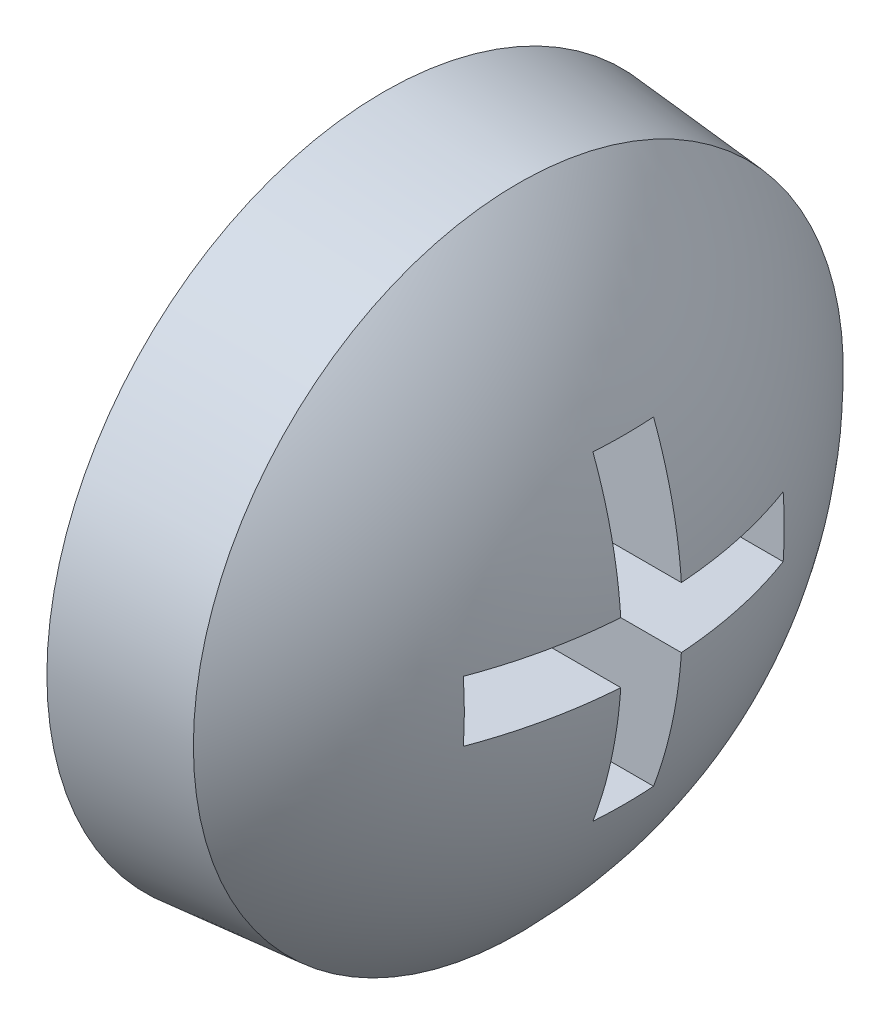
ISO-10303-21;
HEADER;
FILE_DESCRIPTION(('STEP AP214'),'2;1');
FILE_NAME('part.step','',(''),(''),'','','');
FILE_SCHEMA(('AUTOMOTIVE_DESIGN { 1 0 10303 214 1 1 1 1 }'));
ENDSEC;
DATA;
#1=APPLICATION_CONTEXT('core data for automotive mechanical design processes');
#2=APPLICATION_PROTOCOL_DEFINITION('international standard','automotive_design',2000,#1);
#3=PRODUCT_CONTEXT('',#1,'mechanical');
#4=PRODUCT('Part','Part','',(#3));
#5=PRODUCT_RELATED_PRODUCT_CATEGORY('part','',(#4));
#6=PRODUCT_DEFINITION_FORMATION('','',#4);
#7=PRODUCT_DEFINITION_CONTEXT('part definition',#1,'design');
#8=PRODUCT_DEFINITION('design','',#6,#7);
#9=PRODUCT_DEFINITION_SHAPE('','',#8);
#10=(LENGTH_UNIT() NAMED_UNIT(*) SI_UNIT(.MILLI.,.METRE.));
#11=(NAMED_UNIT(*) PLANE_ANGLE_UNIT() SI_UNIT($,.RADIAN.));
#12=(NAMED_UNIT(*) SI_UNIT($,.STERADIAN.) SOLID_ANGLE_UNIT());
#13=UNCERTAINTY_MEASURE_WITH_UNIT(LENGTH_MEASURE(1.E-05),#10,'distance_accuracy_value','');
#14=(GEOMETRIC_REPRESENTATION_CONTEXT(3) GLOBAL_UNCERTAINTY_ASSIGNED_CONTEXT((#13)) GLOBAL_UNIT_ASSIGNED_CONTEXT((#10,
#11,#12)) REPRESENTATION_CONTEXT('',''));
#15=CARTESIAN_POINT('',(0.,0.,0.));
#16=DIRECTION('',(0.,0.,1.));
#17=DIRECTION('',(1.,0.,0.));
#18=AXIS2_PLACEMENT_3D('',#15,#16,#17);
#19=CARTESIAN_POINT('',(215.733333333333,6.9,10.));
#20=DIRECTION('',(1.,0.,0.));
#21=DIRECTION('',(0.,0.,-1.));
#22=AXIS2_PLACEMENT_3D('',#19,#20,#21);
#23=PLANE('',#22);
#24=DIRECTION('',(0.,0.,1.));
#25=VECTOR('',#24,1.);
#26=CARTESIAN_POINT('',(215.733333333333,5.95,10.));
#27=LINE('',#26,#25);
#28=CARTESIAN_POINT('',(215.733333333333,5.95,9.82));
#29=VERTEX_POINT('',#28);
#30=CARTESIAN_POINT('',(215.733333333333,5.95,10.18));
#31=VERTEX_POINT('',#30);
#32=EDGE_CURVE('E293',#29,#31,#27,.T.);
#33=ORIENTED_EDGE('',*,*,#32,.F.);
#34=DIRECTION('',(0.,1.,0.));
#35=VECTOR('',#34,1.);
#36=CARTESIAN_POINT('',(215.733333333333,6.9,9.82));
#37=LINE('',#36,#35);
#38=CARTESIAN_POINT('',(215.733333333333,6.72,9.82));
#39=VERTEX_POINT('',#38);
#40=EDGE_CURVE('E298',#39,#29,#37,.F.);
#41=ORIENTED_EDGE('',*,*,#40,.F.);
#42=DIRECTION('',(0.,0.,1.));
#43=VECTOR('',#42,1.);
#44=CARTESIAN_POINT('',(215.733333333333,6.72,10.));
#45=LINE('',#44,#43);
#46=CARTESIAN_POINT('',(215.733333333333,6.72,9.05));
#47=VERTEX_POINT('',#46);
#48=EDGE_CURVE('E303',#47,#39,#45,.T.);
#49=ORIENTED_EDGE('',*,*,#48,.F.);
#50=DIRECTION('',(0.,1.,0.));
#51=VECTOR('',#50,1.);
#52=CARTESIAN_POINT('',(215.733333333333,6.9,9.05));
#53=LINE('',#52,#51);
#54=CARTESIAN_POINT('',(215.733333333333,7.08,9.05));
#55=VERTEX_POINT('',#54);
#56=EDGE_CURVE('E308',#55,#47,#53,.F.);
#57=ORIENTED_EDGE('',*,*,#56,.F.);
#58=DIRECTION('',(0.,0.,-1.));
#59=VECTOR('',#58,1.);
#60=CARTESIAN_POINT('',(215.733333333333,7.08,10.));
#61=LINE('',#60,#59);
#62=CARTESIAN_POINT('',(215.733333333333,7.08,9.82));
#63=VERTEX_POINT('',#62);
#64=EDGE_CURVE('E313',#63,#55,#61,.T.);
#65=ORIENTED_EDGE('',*,*,#64,.F.);
#66=DIRECTION('',(0.,1.,0.));
#67=VECTOR('',#66,1.);
#68=CARTESIAN_POINT('',(215.733333333333,6.9,9.82));
#69=LINE('',#68,#67);
#70=CARTESIAN_POINT('',(215.733333333333,7.85,9.82));
#71=VERTEX_POINT('',#70);
#72=EDGE_CURVE('E318',#71,#63,#69,.F.);
#73=ORIENTED_EDGE('',*,*,#72,.F.);
#74=DIRECTION('',(0.,0.,1.));
#75=VECTOR('',#74,1.);
#76=CARTESIAN_POINT('',(215.733333333333,7.85,10.));
#77=LINE('',#76,#75);
#78=CARTESIAN_POINT('',(215.733333333333,7.85,10.18));
#79=VERTEX_POINT('',#78);
#80=EDGE_CURVE('E267',#71,#79,#77,.T.);
#81=ORIENTED_EDGE('',*,*,#80,.T.);
#82=DIRECTION('',(0.,1.,0.));
#83=VECTOR('',#82,1.);
#84=CARTESIAN_POINT('',(215.733333333333,6.9,10.18));
#85=LINE('',#84,#83);
#86=CARTESIAN_POINT('',(215.733333333333,7.08,10.18));
#87=VERTEX_POINT('',#86);
#88=EDGE_CURVE('E264',#87,#79,#85,.T.);
#89=ORIENTED_EDGE('',*,*,#88,.F.);
#90=DIRECTION('',(0.,0.,-1.));
#91=VECTOR('',#90,1.);
#92=CARTESIAN_POINT('',(215.733333333333,7.08,10.));
#93=LINE('',#92,#91);
#94=CARTESIAN_POINT('',(215.733333333333,7.08,10.95));
#95=VERTEX_POINT('',#94);
#96=EDGE_CURVE('E260',#95,#87,#93,.T.);
#97=ORIENTED_EDGE('',*,*,#96,.F.);
#98=DIRECTION('',(0.,1.,0.));
#99=VECTOR('',#98,1.);
#100=CARTESIAN_POINT('',(215.733333333333,6.9,10.95));
#101=LINE('',#100,#99);
#102=CARTESIAN_POINT('',(215.733333333333,6.72,10.95));
#103=VERTEX_POINT('',#102);
#104=EDGE_CURVE('E231',#95,#103,#101,.F.);
#105=ORIENTED_EDGE('',*,*,#104,.T.);
#106=DIRECTION('',(0.,0.,1.));
#107=VECTOR('',#106,1.);
#108=CARTESIAN_POINT('',(215.733333333333,6.72,10.));
#109=LINE('',#108,#107);
#110=CARTESIAN_POINT('',(215.733333333333,6.72,10.18));
#111=VERTEX_POINT('',#110);
#112=EDGE_CURVE('E278',#111,#103,#109,.T.);
#113=ORIENTED_EDGE('',*,*,#112,.F.);
#114=DIRECTION('',(0.,1.,0.));
#115=VECTOR('',#114,1.);
#116=CARTESIAN_POINT('',(215.733333333333,6.9,10.18));
#117=LINE('',#116,#115);
#118=EDGE_CURVE('E288',#31,#111,#117,.T.);
#119=ORIENTED_EDGE('',*,*,#118,.F.);
#120=EDGE_LOOP('',(#33,#41,#49,#57,#65,#73,#81,#89,#97,#105,#113,#119));
#121=FACE_BOUND('',#120,.T.);
#122=ADVANCED_FACE('F17',(#121),#23,.T.);
#123=CARTESIAN_POINT('',(216.333333333333,7.08,10.));
#124=DIRECTION('',(0.,-1.,0.));
#125=DIRECTION('',(0.,0.,-1.));
#126=AXIS2_PLACEMENT_3D('',#123,#124,#125);
#127=PLANE('',#126);
#128=DIRECTION('',(1.,0.,0.));
#129=VECTOR('',#128,1.);
#130=CARTESIAN_POINT('',(216.333333333333,7.08,10.95));
#131=LINE('',#130,#129);
#132=CARTESIAN_POINT('',(216.756237856524,7.08,10.9500000000001));
#133=VERTEX_POINT('',#132);
#134=EDGE_CURVE('E89',#133,#95,#131,.F.);
#135=ORIENTED_EDGE('',*,*,#134,.T.);
#136=ORIENTED_EDGE('',*,*,#96,.T.);
#137=DIRECTION('',(-1.,0.,0.));
#138=VECTOR('',#137,1.);
#139=CARTESIAN_POINT('',(216.333333333333,7.08,10.18));
#140=LINE('',#139,#138);
#141=CARTESIAN_POINT('',(216.921430903127,7.08000000000001,10.18));
#142=VERTEX_POINT('',#141);
#143=EDGE_CURVE('E224',#142,#87,#140,.T.);
#144=ORIENTED_EDGE('',*,*,#143,.F.);
#145=CARTESIAN_POINT('',(216.756237856524,7.08,10.9500000000001));
#146=CARTESIAN_POINT('',(216.767782870718,7.08,10.9189995540507));
#147=CARTESIAN_POINT('',(216.778762253102,7.08,10.8877884938069));
#148=CARTESIAN_POINT('',(216.79953545164,7.08,10.825110453647));
#149=CARTESIAN_POINT('',(216.809333758651,7.08,10.7936449620742));
#150=CARTESIAN_POINT('',(216.827757299291,7.08,10.7304618501357));
#151=CARTESIAN_POINT('',(216.83638553892,7.08,10.6987451062673));
#152=CARTESIAN_POINT('',(216.852477288087,7.08,10.6350619663156));
#153=CARTESIAN_POINT('',(216.859942316909,7.08,10.6030959541243));
#154=CARTESIAN_POINT('',(216.873711495295,7.08,10.5389148788569));
#155=CARTESIAN_POINT('',(216.88001564486,7.08,10.5066998157809));
#156=CARTESIAN_POINT('',(216.891462392226,7.08,10.4420201537525));
#157=CARTESIAN_POINT('',(216.896603446971,7.08,10.4095552817086));
#158=CARTESIAN_POINT('',(216.905718495644,7.08,10.3443751591894));
#159=CARTESIAN_POINT('',(216.909689388573,7.08,10.3116594750373));
#160=CARTESIAN_POINT('',(216.916454375482,7.08,10.2459761632456));
#161=CARTESIAN_POINT('',(216.919243763301,7.08,10.2130080508538));
#162=CARTESIAN_POINT('',(216.921430903127,7.08,10.18));
#163=B_SPLINE_CURVE_WITH_KNOTS('',3,(#145,#146,#147,#148,#149,#150,#151,#152,#153,#154,#155,
#156,#157,#158,#159,#160,#161,#162),.UNSPECIFIED.,.F.,.F.,(4,2,2,2,2,2,2,2,4),(0.,
0.0992357442434492,0.198081387639303,0.296668072480549,0.395124892694158,0.49358171290778,
0.592168397749024,0.691014041144897,0.790249785388334),.UNSPECIFIED.);
#164=EDGE_CURVE('E20',#133,#142,#163,.T.);
#165=ORIENTED_EDGE('',*,*,#164,.F.);
#166=EDGE_LOOP('',(#135,#136,#144,#165));
#167=FACE_BOUND('',#166,.T.);
#168=ADVANCED_FACE('F221',(#167),#127,.T.);
#169=CARTESIAN_POINT('',(216.333333333333,6.9,10.18));
#170=DIRECTION('',(0.,0.,-1.));
#171=DIRECTION('',(-1.,0.,0.));
#172=AXIS2_PLACEMENT_3D('',#169,#170,#171);
#173=PLANE('',#172);
#174=ORIENTED_EDGE('',*,*,#88,.T.);
#175=DIRECTION('',(1.,0.,0.));
#176=VECTOR('',#175,1.);
#177=CARTESIAN_POINT('',(216.333333333333,7.85,10.18));
#178=LINE('',#177,#176);
#179=CARTESIAN_POINT('',(216.756237856524,7.85,10.18));
#180=VERTEX_POINT('',#179);
#181=EDGE_CURVE('E324',#79,#180,#178,.T.);
#182=ORIENTED_EDGE('',*,*,#181,.T.);
#183=CARTESIAN_POINT('',(216.921430903127,7.08000000000002,10.18));
#184=CARTESIAN_POINT('',(216.915776724439,7.16559008255584,10.18));
#185=CARTESIAN_POINT('',(216.906045237038,7.25090347737772,10.18));
#186=CARTESIAN_POINT('',(216.878678119522,7.41965906159773,10.18));
#187=CARTESIAN_POINT('',(216.861096565483,7.503110019482,10.18));
#188=CARTESIAN_POINT('',(216.816367435921,7.67504249159054,10.18));
#189=CARTESIAN_POINT('',(216.788531372825,7.76334531100357,10.18));
#190=CARTESIAN_POINT('',(216.756237856524,7.85000000000014,10.18));
#191=B_SPLINE_CURVE_WITH_KNOTS('',3,(#183,#184,#185,#186,#187,#188,#189,#190),.UNSPECIFIED.,.F.,
.F.,(4,2,2,4),(0.,0.257221658829358,0.512698117737381,0.789983486231736),.UNSPECIFIED.);
#192=EDGE_CURVE('E213',#142,#180,#191,.T.);
#193=ORIENTED_EDGE('',*,*,#192,.F.);
#194=ORIENTED_EDGE('',*,*,#143,.T.);
#195=EDGE_LOOP('',(#174,#182,#193,#194));
#196=FACE_BOUND('',#195,.T.);
#197=ADVANCED_FACE('F204',(#196),#173,.T.);
#198=CARTESIAN_POINT('',(216.333333333333,7.85,10.));
#199=DIRECTION('',(0.,1.,0.));
#200=DIRECTION('',(0.,0.,1.));
#201=AXIS2_PLACEMENT_3D('',#198,#199,#200);
#202=PLANE('',#201);
#203=ORIENTED_EDGE('',*,*,#181,.F.);
#204=ORIENTED_EDGE('',*,*,#80,.F.);
#205=DIRECTION('',(1.,0.,0.));
#206=VECTOR('',#205,1.);
#207=CARTESIAN_POINT('',(216.333333333333,7.85,9.82));
#208=LINE('',#207,#206);
#209=CARTESIAN_POINT('',(216.756237856524,7.85000000000008,9.82));
#210=VERTEX_POINT('',#209);
#211=EDGE_CURVE('E320',#210,#71,#208,.F.);
#212=ORIENTED_EDGE('',*,*,#211,.F.);
#213=CARTESIAN_POINT('',(216.756237856524,7.85,10.18));
#214=CARTESIAN_POINT('',(216.760466252223,7.85000000000002,10.12));
#215=CARTESIAN_POINT('',(216.762580450072,7.85000000000002,10.06));
#216=CARTESIAN_POINT('',(216.762580450072,7.84999999999998,9.93999999999995));
#217=CARTESIAN_POINT('',(216.760466252223,7.84999999999994,9.87999999999993));
#218=CARTESIAN_POINT('',(216.756237856524,7.84999999999989,9.81999999999991));
#219=B_SPLINE_CURVE_WITH_KNOTS('',3,(#213,#214,#215,#216,#217,#218),.UNSPECIFIED.,.F.,.F.,(4,2,
4),(0.,0.180111711148749,0.360223422297499),.UNSPECIFIED.);
#220=EDGE_CURVE('E207',#180,#210,#219,.T.);
#221=ORIENTED_EDGE('',*,*,#220,.F.);
#222=EDGE_LOOP('',(#203,#204,#212,#221));
#223=FACE_BOUND('',#222,.T.);
#224=ADVANCED_FACE('F199',(#223),#202,.F.);
#225=CARTESIAN_POINT('',(216.333333333333,6.9,9.82));
#226=DIRECTION('',(0.,0.,1.));
#227=DIRECTION('',(1.,0.,0.));
#228=AXIS2_PLACEMENT_3D('',#225,#226,#227);
#229=PLANE('',#228);
#230=ORIENTED_EDGE('',*,*,#72,.T.);
#231=DIRECTION('',(1.,0.,0.));
#232=VECTOR('',#231,1.);
#233=CARTESIAN_POINT('',(216.333333333333,7.08,9.82));
#234=LINE('',#233,#232);
#235=CARTESIAN_POINT('',(216.921430903127,7.08,9.81999999999999));
#236=VERTEX_POINT('',#235);
#237=EDGE_CURVE('E315',#236,#63,#234,.F.);
#238=ORIENTED_EDGE('',*,*,#237,.F.);
#239=CARTESIAN_POINT('',(216.756237856524,7.85000000000015,9.82));
#240=CARTESIAN_POINT('',(216.767782870718,7.81899955405073,9.82));
#241=CARTESIAN_POINT('',(216.778762253102,7.78778849380686,9.82));
#242=CARTESIAN_POINT('',(216.79953545164,7.72511045364697,9.82));
#243=CARTESIAN_POINT('',(216.809333758651,7.69364496207417,9.82));
#244=CARTESIAN_POINT('',(216.827757299291,7.63046185013571,9.82));
#245=CARTESIAN_POINT('',(216.83638553892,7.59874510626735,9.82));
#246=CARTESIAN_POINT('',(216.852477288087,7.5350619663156,9.82));
#247=CARTESIAN_POINT('',(216.859942316909,7.50309595412428,9.82));
#248=CARTESIAN_POINT('',(216.873711495295,7.43891487885692,9.82));
#249=CARTESIAN_POINT('',(216.88001564486,7.40669981578088,9.82));
#250=CARTESIAN_POINT('',(216.891462392226,7.34202015375246,9.82));
#251=CARTESIAN_POINT('',(216.896603446971,7.30955528170863,9.82));
#252=CARTESIAN_POINT('',(216.905718495644,7.24437515918937,9.82));
#253=CARTESIAN_POINT('',(216.909689388573,7.21165947503727,9.82));
#254=CARTESIAN_POINT('',(216.916454375482,7.14597616324564,9.82));
#255=CARTESIAN_POINT('',(216.919243763301,7.11300805085381,9.82));
#256=CARTESIAN_POINT('',(216.921430903127,7.08000000000002,9.82));
#257=B_SPLINE_CURVE_WITH_KNOTS('',3,(#239,#240,#241,#242,#243,#244,#245,#246,#247,#248,#249,
#250,#251,#252,#253,#254,#255,#256),.UNSPECIFIED.,.F.,.F.,(4,2,2,2,2,2,2,2,4),(0.,
0.0992357442434468,0.198081387639302,0.296668072480547,0.395124892694157,0.493581712907778,
0.592168397749022,0.691014041144895,0.79024978538833),.UNSPECIFIED.);
#258=EDGE_CURVE('E184',#210,#236,#257,.T.);
#259=ORIENTED_EDGE('',*,*,#258,.F.);
#260=ORIENTED_EDGE('',*,*,#211,.T.);
#261=EDGE_LOOP('',(#230,#238,#259,#260));
#262=FACE_BOUND('',#261,.T.);
#263=ADVANCED_FACE('F194',(#262),#229,.T.);
#264=CARTESIAN_POINT('',(216.333333333333,7.08,10.));
#265=DIRECTION('',(0.,-1.,0.));
#266=DIRECTION('',(0.,0.,-1.));
#267=AXIS2_PLACEMENT_3D('',#264,#265,#266);
#268=PLANE('',#267);
#269=DIRECTION('',(1.,0.,0.));
#270=VECTOR('',#269,1.);
#271=CARTESIAN_POINT('',(216.333333333333,7.08,9.05));
#272=LINE('',#271,#270);
#273=CARTESIAN_POINT('',(216.756237856524,7.08,9.05));
#274=VERTEX_POINT('',#273);
#275=EDGE_CURVE('E310',#274,#55,#272,.F.);
#276=ORIENTED_EDGE('',*,*,#275,.F.);
#277=CARTESIAN_POINT('',(216.921430903127,7.08,9.81999999999998));
#278=CARTESIAN_POINT('',(216.915776724439,7.08,9.73440991744416));
#279=CARTESIAN_POINT('',(216.906045237038,7.08,9.64909652262228));
#280=CARTESIAN_POINT('',(216.878678119522,7.08,9.48034093840228));
#281=CARTESIAN_POINT('',(216.861096565483,7.08,9.396889980518));
#282=CARTESIAN_POINT('',(216.816367435921,7.08,9.22495750840947));
#283=CARTESIAN_POINT('',(216.788531372825,7.08,9.13665468899643));
#284=CARTESIAN_POINT('',(216.756237856524,7.08,9.04999999999986));
#285=B_SPLINE_CURVE_WITH_KNOTS('',3,(#277,#278,#279,#280,#281,#282,#283,#284),.UNSPECIFIED.,.F.,
.F.,(4,2,2,4),(0.,0.257221658829358,0.512698117737381,0.789983486231737),.UNSPECIFIED.);
#286=EDGE_CURVE('E176',#236,#274,#285,.T.);
#287=ORIENTED_EDGE('',*,*,#286,.F.);
#288=ORIENTED_EDGE('',*,*,#237,.T.);
#289=ORIENTED_EDGE('',*,*,#64,.T.);
#290=EDGE_LOOP('',(#276,#287,#288,#289));
#291=FACE_BOUND('',#290,.T.);
#292=ADVANCED_FACE('F191',(#291),#268,.T.);
#293=CARTESIAN_POINT('',(216.333333333333,6.9,9.05));
#294=DIRECTION('',(0.,0.,1.));
#295=DIRECTION('',(1.,0.,0.));
#296=AXIS2_PLACEMENT_3D('',#293,#294,#295);
#297=PLANE('',#296);
#298=DIRECTION('',(1.,0.,0.));
#299=VECTOR('',#298,1.);
#300=CARTESIAN_POINT('',(216.333333333333,6.72,9.05));
#301=LINE('',#300,#299);
#302=CARTESIAN_POINT('',(216.756237856524,6.72,9.04999999999993));
#303=VERTEX_POINT('',#302);
#304=EDGE_CURVE('E305',#303,#47,#301,.F.);
#305=ORIENTED_EDGE('',*,*,#304,.F.);
#306=CARTESIAN_POINT('',(216.756237856524,6.72,9.05));
#307=CARTESIAN_POINT('',(216.762580450072,6.80988825418735,9.05));
#308=CARTESIAN_POINT('',(216.762580450072,6.9,9.05));
#309=B_SPLINE_CURVE_WITH_KNOTS('',2,(#306,#307,#308),.UNSPECIFIED.,.F.,.F.,(3,3),(0.,1.),.UNSPECIFIED.);
#310=CARTESIAN_POINT('',(216.762580450072,6.9,9.05));
#311=VERTEX_POINT('',#310);
#312=EDGE_CURVE('E175',#311,#303,#309,.F.);
#313=ORIENTED_EDGE('',*,*,#312,.F.);
#314=CARTESIAN_POINT('',(216.762580450072,6.9,9.05));
#315=CARTESIAN_POINT('',(216.762580450072,6.9901117458123,9.05));
#316=CARTESIAN_POINT('',(216.756237856524,7.08,9.05));
#317=B_SPLINE_CURVE_WITH_KNOTS('',2,(#314,#315,#316),.UNSPECIFIED.,.F.,.F.,(3,3),(0.,1.),.UNSPECIFIED.);
#318=EDGE_CURVE('E183',#274,#311,#317,.F.);
#319=ORIENTED_EDGE('',*,*,#318,.F.);
#320=ORIENTED_EDGE('',*,*,#275,.T.);
#321=ORIENTED_EDGE('',*,*,#56,.T.);
#322=EDGE_LOOP('',(#305,#313,#319,#320,#321));
#323=FACE_BOUND('',#322,.T.);
#324=ADVANCED_FACE('F164',(#323),#297,.T.);
#325=CARTESIAN_POINT('',(216.333333333333,6.72,10.));
#326=DIRECTION('',(0.,1.,0.));
#327=DIRECTION('',(0.,0.,1.));
#328=AXIS2_PLACEMENT_3D('',#325,#326,#327);
#329=PLANE('',#328);
#330=ORIENTED_EDGE('',*,*,#304,.T.);
#331=ORIENTED_EDGE('',*,*,#48,.T.);
#332=DIRECTION('',(1.,0.,0.));
#333=VECTOR('',#332,1.);
#334=CARTESIAN_POINT('',(216.333333333333,6.72,9.82));
#335=LINE('',#334,#333);
#336=CARTESIAN_POINT('',(216.921430903127,6.71999999999999,9.82));
#337=VERTEX_POINT('',#336);
#338=EDGE_CURVE('E300',#337,#39,#335,.F.);
#339=ORIENTED_EDGE('',*,*,#338,.F.);
#340=CARTESIAN_POINT('',(216.756237856524,6.72,9.04999999999985));
#341=CARTESIAN_POINT('',(216.767782870718,6.72,9.08100044594928));
#342=CARTESIAN_POINT('',(216.778762253102,6.72,9.11221150619314));
#343=CARTESIAN_POINT('',(216.79953545164,6.72,9.17488954635303));
#344=CARTESIAN_POINT('',(216.809333758651,6.72,9.20635503792583));
#345=CARTESIAN_POINT('',(216.827757299291,6.72,9.26953814986429));
#346=CARTESIAN_POINT('',(216.83638553892,6.72,9.30125489373265));
#347=CARTESIAN_POINT('',(216.852477288087,6.72,9.3649380336844));
#348=CARTESIAN_POINT('',(216.859942316909,6.72,9.39690404587572));
#349=CARTESIAN_POINT('',(216.873711495295,6.72,9.46108512114308));
#350=CARTESIAN_POINT('',(216.88001564486,6.72,9.49330018421912));
#351=CARTESIAN_POINT('',(216.891462392226,6.72,9.55797984624754));
#352=CARTESIAN_POINT('',(216.896603446971,6.72,9.59044471829137));
#353=CARTESIAN_POINT('',(216.905718495644,6.72,9.65562484081063));
#354=CARTESIAN_POINT('',(216.909689388573,6.72,9.68834052496273));
#355=CARTESIAN_POINT('',(216.916454375482,6.72,9.75402383675436));
#356=CARTESIAN_POINT('',(216.919243763301,6.72,9.78699194914619));
#357=CARTESIAN_POINT('',(216.921430903127,6.72,9.81999999999998));
#358=B_SPLINE_CURVE_WITH_KNOTS('',3,(#340,#341,#342,#343,#344,#345,#346,#347,#348,#349,#350,
#351,#352,#353,#354,#355,#356,#357),.UNSPECIFIED.,.F.,.F.,(4,2,2,2,2,2,2,2,4),(0.,
0.0992357442434492,0.198081387639303,0.296668072480551,0.395124892694158,0.49358171290778,
0.592168397749025,0.691014041144897,0.790249785388334),.UNSPECIFIED.);
#359=EDGE_CURVE('E168',#303,#337,#358,.T.);
#360=ORIENTED_EDGE('',*,*,#359,.F.);
#361=EDGE_LOOP('',(#330,#331,#339,#360));
#362=FACE_BOUND('',#361,.T.);
#363=ADVANCED_FACE('F159',(#362),#329,.T.);
#364=CARTESIAN_POINT('',(216.333333333333,6.9,9.82));
#365=DIRECTION('',(0.,0.,1.));
#366=DIRECTION('',(1.,0.,0.));
#367=AXIS2_PLACEMENT_3D('',#364,#365,#366);
#368=PLANE('',#367);
#369=ORIENTED_EDGE('',*,*,#40,.T.);
#370=DIRECTION('',(1.,0.,0.));
#371=VECTOR('',#370,1.);
#372=CARTESIAN_POINT('',(216.333333333333,5.95,9.82));
#373=LINE('',#372,#371);
#374=CARTESIAN_POINT('',(216.756237856524,5.95,9.81999999999998));
#375=VERTEX_POINT('',#374);
#376=EDGE_CURVE('E295',#375,#29,#373,.F.);
#377=ORIENTED_EDGE('',*,*,#376,.F.);
#378=CARTESIAN_POINT('',(216.921430903127,6.71999999999997,9.82));
#379=CARTESIAN_POINT('',(216.915776724439,6.63440991744415,9.82));
#380=CARTESIAN_POINT('',(216.906045237038,6.54909652262228,9.82));
#381=CARTESIAN_POINT('',(216.878678119522,6.38034093840227,9.82));
#382=CARTESIAN_POINT('',(216.861096565483,6.29688998051799,9.82));
#383=CARTESIAN_POINT('',(216.816367435921,6.12495750840946,9.82));
#384=CARTESIAN_POINT('',(216.788531372825,6.03665468899643,9.82));
#385=CARTESIAN_POINT('',(216.756237856524,5.94999999999985,9.82));
#386=B_SPLINE_CURVE_WITH_KNOTS('',3,(#378,#379,#380,#381,#382,#383,#384,#385),.UNSPECIFIED.,.F.,
.F.,(4,2,2,4),(0.,0.257221658829362,0.512698117737388,0.789983486231739),.UNSPECIFIED.);
#387=EDGE_CURVE('E144',#337,#375,#386,.T.);
#388=ORIENTED_EDGE('',*,*,#387,.F.);
#389=ORIENTED_EDGE('',*,*,#338,.T.);
#390=EDGE_LOOP('',(#369,#377,#388,#389));
#391=FACE_BOUND('',#390,.T.);
#392=ADVANCED_FACE('F154',(#391),#368,.T.);
#393=CARTESIAN_POINT('',(216.333333333333,5.95,10.));
#394=DIRECTION('',(0.,1.,0.));
#395=DIRECTION('',(0.,0.,1.));
#396=AXIS2_PLACEMENT_3D('',#393,#394,#395);
#397=PLANE('',#396);
#398=ORIENTED_EDGE('',*,*,#32,.T.);
#399=DIRECTION('',(-1.,0.,0.));
#400=VECTOR('',#399,1.);
#401=CARTESIAN_POINT('',(216.333333333333,5.95,10.18));
#402=LINE('',#401,#400);
#403=CARTESIAN_POINT('',(216.756237856524,5.94999999999992,10.18));
#404=VERTEX_POINT('',#403);
#405=EDGE_CURVE('E290',#404,#31,#402,.T.);
#406=ORIENTED_EDGE('',*,*,#405,.F.);
#407=CARTESIAN_POINT('',(216.756237856524,5.95,9.81999999999997));
#408=CARTESIAN_POINT('',(216.760466252223,5.94999999999999,9.87999999999999));
#409=CARTESIAN_POINT('',(216.762580450072,5.94999999999999,9.94000000000001));
#410=CARTESIAN_POINT('',(216.762580450072,5.95000000000001,10.0600000000001));
#411=CARTESIAN_POINT('',(216.760466252223,5.95000000000003,10.1200000000001));
#412=CARTESIAN_POINT('',(216.756237856524,5.95000000000006,10.1800000000001));
#413=B_SPLINE_CURVE_WITH_KNOTS('',3,(#407,#408,#409,#410,#411,#412),.UNSPECIFIED.,.F.,.F.,(4,2,
4),(0.,0.180111711148752,0.360223422297503),.UNSPECIFIED.);
#414=EDGE_CURVE('E137',#375,#404,#413,.T.);
#415=ORIENTED_EDGE('',*,*,#414,.F.);
#416=ORIENTED_EDGE('',*,*,#376,.T.);
#417=EDGE_LOOP('',(#398,#406,#415,#416));
#418=FACE_BOUND('',#417,.T.);
#419=ADVANCED_FACE('F151',(#418),#397,.T.);
#420=CARTESIAN_POINT('',(216.333333333333,6.9,10.18));
#421=DIRECTION('',(0.,0.,-1.));
#422=DIRECTION('',(-1.,0.,0.));
#423=AXIS2_PLACEMENT_3D('',#420,#421,#422);
#424=PLANE('',#423);
#425=ORIENTED_EDGE('',*,*,#118,.T.);
#426=DIRECTION('',(1.,0.,0.));
#427=VECTOR('',#426,1.);
#428=CARTESIAN_POINT('',(216.333333333333,6.72,10.18));
#429=LINE('',#428,#427);
#430=CARTESIAN_POINT('',(216.921430903127,6.72,10.18));
#431=VERTEX_POINT('',#430);
#432=EDGE_CURVE('E280',#431,#111,#429,.F.);
#433=ORIENTED_EDGE('',*,*,#432,.F.);
#434=CARTESIAN_POINT('',(216.756237856524,5.94999999999985,10.18));
#435=CARTESIAN_POINT('',(216.767782870718,5.98100044594928,10.18));
#436=CARTESIAN_POINT('',(216.778762253102,6.01221150619314,10.18));
#437=CARTESIAN_POINT('',(216.79953545164,6.07488954635303,10.18));
#438=CARTESIAN_POINT('',(216.809333758651,6.10635503792583,10.18));
#439=CARTESIAN_POINT('',(216.827757299291,6.16953814986429,10.18));
#440=CARTESIAN_POINT('',(216.83638553892,6.20125489373265,10.18));
#441=CARTESIAN_POINT('',(216.852477288087,6.2649380336844,10.18));
#442=CARTESIAN_POINT('',(216.859942316909,6.29690404587572,10.18));
#443=CARTESIAN_POINT('',(216.873711495295,6.36108512114308,10.18));
#444=CARTESIAN_POINT('',(216.88001564486,6.39330018421912,10.18));
#445=CARTESIAN_POINT('',(216.891462392226,6.45797984624754,10.18));
#446=CARTESIAN_POINT('',(216.896603446971,6.49044471829137,10.18));
#447=CARTESIAN_POINT('',(216.905718495644,6.55562484081063,10.18));
#448=CARTESIAN_POINT('',(216.909689388573,6.58834052496273,10.18));
#449=CARTESIAN_POINT('',(216.916454375482,6.65402383675436,10.18));
#450=CARTESIAN_POINT('',(216.919243763301,6.68699194914619,10.18));
#451=CARTESIAN_POINT('',(216.921430903127,6.71999999999998,10.18));
#452=B_SPLINE_CURVE_WITH_KNOTS('',3,(#434,#435,#436,#437,#438,#439,#440,#441,#442,#443,#444,
#445,#446,#447,#448,#449,#450,#451),.UNSPECIFIED.,.F.,.F.,(4,2,2,2,2,2,2,2,4),(0.,
0.0992357442434457,0.198081387639302,0.296668072480549,0.395124892694158,0.493581712907781,
0.592168397749024,0.691014041144898,0.790249785388334),.UNSPECIFIED.);
#453=EDGE_CURVE('E100',#404,#431,#452,.T.);
#454=ORIENTED_EDGE('',*,*,#453,.F.);
#455=ORIENTED_EDGE('',*,*,#405,.T.);
#456=EDGE_LOOP('',(#425,#433,#454,#455));
#457=FACE_BOUND('',#456,.T.);
#458=ADVANCED_FACE('F123',(#457),#424,.T.);
#459=CARTESIAN_POINT('',(216.333333333333,6.72,10.));
#460=DIRECTION('',(0.,1.,0.));
#461=DIRECTION('',(0.,0.,1.));
#462=AXIS2_PLACEMENT_3D('',#459,#460,#461);
#463=PLANE('',#462);
#464=DIRECTION('',(1.,0.,0.));
#465=VECTOR('',#464,1.);
#466=CARTESIAN_POINT('',(216.333333333333,6.72,10.95));
#467=LINE('',#466,#465);
#468=CARTESIAN_POINT('',(216.756237856524,6.72,10.95));
#469=VERTEX_POINT('',#468);
#470=EDGE_CURVE('E40',#103,#469,#467,.T.);
#471=ORIENTED_EDGE('',*,*,#470,.T.);
#472=CARTESIAN_POINT('',(216.921430903127,6.72,10.18));
#473=CARTESIAN_POINT('',(216.915776724439,6.72,10.2655900825558));
#474=CARTESIAN_POINT('',(216.906045237038,6.72,10.3509034773777));
#475=CARTESIAN_POINT('',(216.878678119522,6.72,10.5196590615977));
#476=CARTESIAN_POINT('',(216.861096565483,6.72,10.603110019482));
#477=CARTESIAN_POINT('',(216.816367435921,6.72,10.7750424915905));
#478=CARTESIAN_POINT('',(216.788531372825,6.72,10.8633453110036));
#479=CARTESIAN_POINT('',(216.756237856524,6.72,10.9500000000001));
#480=B_SPLINE_CURVE_WITH_KNOTS('',3,(#472,#473,#474,#475,#476,#477,#478,#479),.UNSPECIFIED.,.F.,
.F.,(4,2,2,4),(0.,0.257221658829362,0.512698117737387,0.789983486231737),.UNSPECIFIED.);
#481=EDGE_CURVE('E96',#431,#469,#480,.T.);
#482=ORIENTED_EDGE('',*,*,#481,.F.);
#483=ORIENTED_EDGE('',*,*,#432,.T.);
#484=ORIENTED_EDGE('',*,*,#112,.T.);
#485=EDGE_LOOP('',(#471,#482,#483,#484));
#486=FACE_BOUND('',#485,.T.);
#487=ADVANCED_FACE('F115',(#486),#463,.T.);
#488=CARTESIAN_POINT('',(216.333333333333,6.9,10.95));
#489=DIRECTION('',(0.,0.,1.));
#490=DIRECTION('',(1.,0.,0.));
#491=AXIS2_PLACEMENT_3D('',#488,#489,#490);
#492=PLANE('',#491);
#493=ORIENTED_EDGE('',*,*,#470,.F.);
#494=ORIENTED_EDGE('',*,*,#104,.F.);
#495=ORIENTED_EDGE('',*,*,#134,.F.);
#496=CARTESIAN_POINT('',(216.762580450072,6.9,10.95));
#497=CARTESIAN_POINT('',(216.762580450072,6.99011174581231,10.95));
#498=CARTESIAN_POINT('',(216.756237856524,7.08,10.95));
#499=B_SPLINE_CURVE_WITH_KNOTS('',2,(#496,#497,#498),.UNSPECIFIED.,.F.,.F.,(3,3),(0.,1.),.UNSPECIFIED.);
#500=CARTESIAN_POINT('',(216.762580450072,6.9,10.95));
#501=VERTEX_POINT('',#500);
#502=EDGE_CURVE('E82',#501,#133,#499,.T.);
#503=ORIENTED_EDGE('',*,*,#502,.F.);
#504=CARTESIAN_POINT('',(216.756237856524,6.72,10.95));
#505=CARTESIAN_POINT('',(216.762580450072,6.80988825418735,10.95));
#506=CARTESIAN_POINT('',(216.762580450072,6.9,10.95));
#507=B_SPLINE_CURVE_WITH_KNOTS('',2,(#504,#505,#506),.UNSPECIFIED.,.F.,.F.,(3,3),(0.,1.),.UNSPECIFIED.);
#508=EDGE_CURVE('E85',#469,#501,#507,.T.);
#509=ORIENTED_EDGE('',*,*,#508,.F.);
#510=EDGE_LOOP('',(#493,#494,#495,#503,#509));
#511=FACE_BOUND('',#510,.T.);
#512=ADVANCED_FACE('F84',(#511),#492,.F.);
#513=CARTESIAN_POINT('',(214.205248953887,6.9,10.));
#514=DIRECTION('',(1.,0.,0.));
#515=DIRECTION('',(0.,1.,0.));
#516=AXIS2_PLACEMENT_3D('',#513,#514,#515);
#517=SPHERICAL_SURFACE('',#516,2.72808437944638);
#518=CARTESIAN_POINT('',(216.133333333346,6.9,10.));
#519=DIRECTION('',(-1.,0.,0.));
#520=DIRECTION('',(0.,0.,1.));
#521=AXIS2_PLACEMENT_3D('',#518,#519,#520);
#522=CIRCLE('',#521,1.93000906918229);
#523=CARTESIAN_POINT('',(216.133333333346,6.89999999999993,11.9300090691823));
#524=VERTEX_POINT('',#523);
#525=EDGE_CURVE('E31',#524,#524,#522,.T.);
#526=ORIENTED_EDGE('',*,*,#525,.F.);
#527=EDGE_LOOP('',(#526));
#528=FACE_BOUND('',#527,.T.);
#529=ORIENTED_EDGE('',*,*,#481,.T.);
#530=ORIENTED_EDGE('',*,*,#508,.T.);
#531=ORIENTED_EDGE('',*,*,#502,.T.);
#532=ORIENTED_EDGE('',*,*,#164,.T.);
#533=ORIENTED_EDGE('',*,*,#192,.T.);
#534=ORIENTED_EDGE('',*,*,#220,.T.);
#535=ORIENTED_EDGE('',*,*,#258,.T.);
#536=ORIENTED_EDGE('',*,*,#286,.T.);
#537=ORIENTED_EDGE('',*,*,#318,.T.);
#538=ORIENTED_EDGE('',*,*,#312,.T.);
#539=ORIENTED_EDGE('',*,*,#359,.T.);
#540=ORIENTED_EDGE('',*,*,#387,.T.);
#541=ORIENTED_EDGE('',*,*,#414,.T.);
#542=ORIENTED_EDGE('',*,*,#453,.T.);
#543=EDGE_LOOP('',(#529,#530,#531,#532,#533,#534,#535,#536,#537,#538,#539,#540,#541,#542));
#544=FACE_BOUND('',#543,.T.);
#545=ADVANCED_FACE('F94',(#528,#544),#517,.T.);
#546=CARTESIAN_POINT('',(215.333333333319,6.9,10.));
#547=DIRECTION('',(-1.,0.,0.));
#548=DIRECTION('',(0.,0.,1.));
#549=AXIS2_PLACEMENT_3D('',#546,#547,#548);
#550=CONICAL_SURFACE('',#549,2.00000000000756,0.0872664626024547);
#551=CARTESIAN_POINT('',(215.333333333319,6.9,10.));
#552=DIRECTION('',(-1.,0.,0.));
#553=DIRECTION('',(0.,0.,1.));
#554=AXIS2_PLACEMENT_3D('',#551,#552,#553);
#555=CIRCLE('',#554,2.00000000000756);
#556=CARTESIAN_POINT('',(215.333333333319,6.9,12.0000000000076));
#557=VERTEX_POINT('',#556);
#558=EDGE_CURVE('E11',#557,#557,#555,.T.);
#559=ORIENTED_EDGE('',*,*,#558,.F.);
#560=EDGE_LOOP('',(#559));
#561=FACE_BOUND('',#560,.T.);
#562=ORIENTED_EDGE('',*,*,#525,.T.);
#563=EDGE_LOOP('',(#562));
#564=FACE_BOUND('',#563,.T.);
#565=ADVANCED_FACE('F402',(#561,#564),#550,.T.);
#566=CARTESIAN_POINT('',(215.333333333333,6.9,11.));
#567=DIRECTION('',(-1.,0.,0.));
#568=DIRECTION('',(0.,0.,1.));
#569=AXIS2_PLACEMENT_3D('',#566,#567,#568);
#570=PLANE('',#569);
#571=ORIENTED_EDGE('',*,*,#558,.T.);
#572=EDGE_LOOP('',(#571));
#573=FACE_BOUND('',#572,.T.);
#574=ADVANCED_FACE('F400',(#573),#570,.T.);
#575=CLOSED_SHELL('',(#122,#168,#197,#224,#263,#292,#324,#363,#392,#419,#458,#487,#512,#545,
#565,#574));
#576=MANIFOLD_SOLID_BREP('B1',#575);
#577=ADVANCED_BREP_SHAPE_REPRESENTATION('',(#18,#576),#14);
#578=SHAPE_DEFINITION_REPRESENTATION(#9,#577);
ENDSEC;
END-ISO-10303-21;
